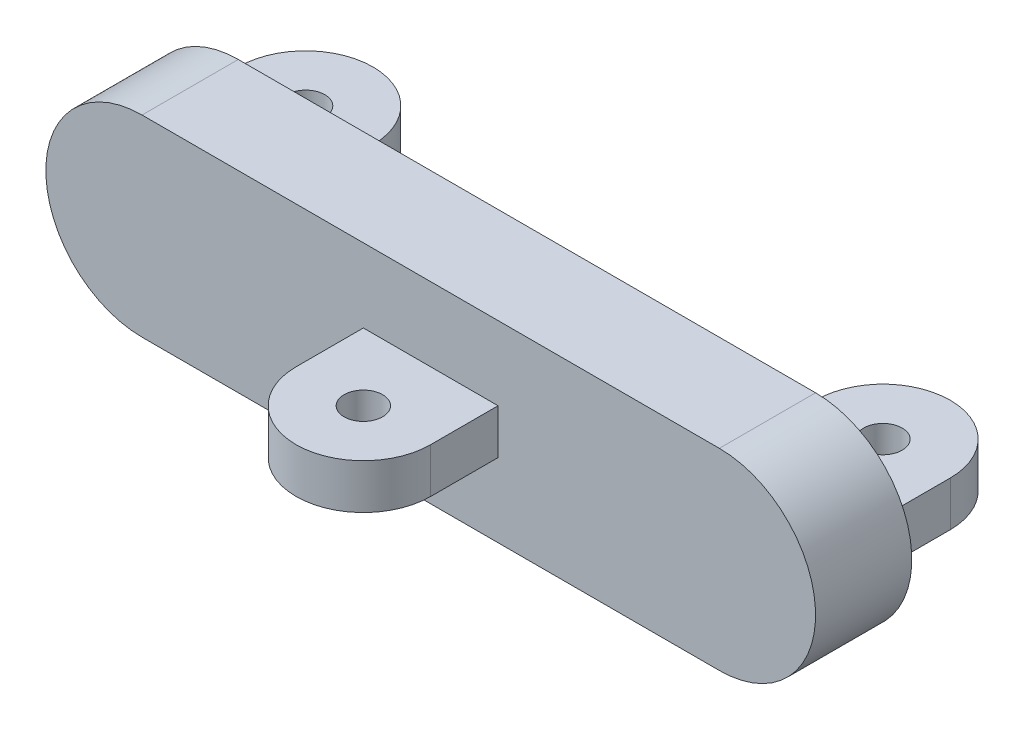
ISO-10303-21;
HEADER;
FILE_DESCRIPTION(('STEP AP214'),'2;1');
FILE_NAME('part.step','',(''),(''),'','','');
FILE_SCHEMA(('AUTOMOTIVE_DESIGN { 1 0 10303 214 1 1 1 1 }'));
ENDSEC;
DATA;
#1=APPLICATION_CONTEXT('core data for automotive mechanical design processes');
#2=APPLICATION_PROTOCOL_DEFINITION('international standard','automotive_design',2000,#1);
#3=PRODUCT_CONTEXT('',#1,'mechanical');
#4=PRODUCT('Part','Part','',(#3));
#5=PRODUCT_RELATED_PRODUCT_CATEGORY('part','',(#4));
#6=PRODUCT_DEFINITION_FORMATION('','',#4);
#7=PRODUCT_DEFINITION_CONTEXT('part definition',#1,'design');
#8=PRODUCT_DEFINITION('design','',#6,#7);
#9=PRODUCT_DEFINITION_SHAPE('','',#8);
#10=(LENGTH_UNIT() NAMED_UNIT(*) SI_UNIT(.MILLI.,.METRE.));
#11=(NAMED_UNIT(*) PLANE_ANGLE_UNIT() SI_UNIT($,.RADIAN.));
#12=(NAMED_UNIT(*) SI_UNIT($,.STERADIAN.) SOLID_ANGLE_UNIT());
#13=UNCERTAINTY_MEASURE_WITH_UNIT(LENGTH_MEASURE(1.E-05),#10,'distance_accuracy_value','');
#14=(GEOMETRIC_REPRESENTATION_CONTEXT(3) GLOBAL_UNCERTAINTY_ASSIGNED_CONTEXT((#13)) GLOBAL_UNIT_ASSIGNED_CONTEXT((#10,
#11,#12)) REPRESENTATION_CONTEXT('',''));
#15=CARTESIAN_POINT('',(0.,0.,0.));
#16=DIRECTION('',(0.,0.,1.));
#17=DIRECTION('',(1.,0.,0.));
#18=AXIS2_PLACEMENT_3D('',#15,#16,#17);
#19=CARTESIAN_POINT('',(15.,0.,-5.));
#20=DIRECTION('',(0.,0.,1.));
#21=DIRECTION('',(1.,0.,0.));
#22=AXIS2_PLACEMENT_3D('',#19,#20,#21);
#23=PLANE('',#22);
#24=DIRECTION('',(0.,1.,0.));
#25=VECTOR('',#24,1.);
#26=CARTESIAN_POINT('',(11.5,-1.165,-5.));
#27=LINE('',#26,#25);
#28=CARTESIAN_POINT('',(11.5,-1.165,-5.));
#29=VERTEX_POINT('',#28);
#30=CARTESIAN_POINT('',(11.5,1.165,-5.));
#31=VERTEX_POINT('',#30);
#32=EDGE_CURVE('E223',#29,#31,#27,.T.);
#33=ORIENTED_EDGE('',*,*,#32,.F.);
#34=DIRECTION('',(-1.,0.,0.));
#35=VECTOR('',#34,1.);
#36=CARTESIAN_POINT('',(18.5,-1.165,-5.));
#37=LINE('',#36,#35);
#38=CARTESIAN_POINT('',(18.5,-1.165,-5.));
#39=VERTEX_POINT('',#38);
#40=EDGE_CURVE('E231',#39,#29,#37,.T.);
#41=ORIENTED_EDGE('',*,*,#40,.F.);
#42=DIRECTION('',(0.,-1.,0.));
#43=VECTOR('',#42,1.);
#44=CARTESIAN_POINT('',(18.5,-1.165,-5.));
#45=LINE('',#44,#43);
#46=CARTESIAN_POINT('',(18.5,1.165,-5.));
#47=VERTEX_POINT('',#46);
#48=EDGE_CURVE('E243',#47,#39,#45,.T.);
#49=ORIENTED_EDGE('',*,*,#48,.F.);
#50=DIRECTION('',(1.,0.,0.));
#51=VECTOR('',#50,1.);
#52=CARTESIAN_POINT('',(18.5,1.165,-5.));
#53=LINE('',#52,#51);
#54=EDGE_CURVE('E239',#31,#47,#53,.T.);
#55=ORIENTED_EDGE('',*,*,#54,.F.);
#56=EDGE_LOOP('',(#33,#41,#49,#55));
#57=FACE_BOUND('',#56,.T.);
#58=CARTESIAN_POINT('',(15.,0.,-5.));
#59=DIRECTION('',(0.,0.,1.));
#60=DIRECTION('',(1.,0.,0.));
#61=AXIS2_PLACEMENT_3D('',#58,#59,#60);
#62=CIRCLE('',#61,5.);
#63=CARTESIAN_POINT('',(15.,-5.,-5.));
#64=VERTEX_POINT('',#63);
#65=CARTESIAN_POINT('',(15.,5.,-5.));
#66=VERTEX_POINT('',#65);
#67=EDGE_CURVE('E318',#64,#66,#62,.T.);
#68=ORIENTED_EDGE('',*,*,#67,.F.);
#69=DIRECTION('',(1.,0.,0.));
#70=VECTOR('',#69,1.);
#71=CARTESIAN_POINT('',(-15.,-5.,-5.));
#72=LINE('',#71,#70);
#73=CARTESIAN_POINT('',(-15.,-5.,-5.));
#74=VERTEX_POINT('',#73);
#75=EDGE_CURVE('E331',#74,#64,#72,.T.);
#76=ORIENTED_EDGE('',*,*,#75,.F.);
#77=CARTESIAN_POINT('',(-15.,0.,-5.));
#78=DIRECTION('',(0.,0.,1.));
#79=DIRECTION('',(-1.,0.,0.));
#80=AXIS2_PLACEMENT_3D('',#77,#78,#79);
#81=CIRCLE('',#80,5.);
#82=CARTESIAN_POINT('',(-15.,5.,-5.));
#83=VERTEX_POINT('',#82);
#84=EDGE_CURVE('E327',#83,#74,#81,.T.);
#85=ORIENTED_EDGE('',*,*,#84,.F.);
#86=DIRECTION('',(-1.,0.,0.));
#87=VECTOR('',#86,1.);
#88=CARTESIAN_POINT('',(-15.,5.,-5.));
#89=LINE('',#88,#87);
#90=EDGE_CURVE('E322',#66,#83,#89,.T.);
#91=ORIENTED_EDGE('',*,*,#90,.F.);
#92=EDGE_LOOP('',(#68,#76,#85,#91));
#93=FACE_BOUND('',#92,.T.);
#94=DIRECTION('',(0.,1.,0.));
#95=VECTOR('',#94,1.);
#96=CARTESIAN_POINT('',(-18.5,-1.165,-5.));
#97=LINE('',#96,#95);
#98=CARTESIAN_POINT('',(-18.5,-1.165,-5.));
#99=VERTEX_POINT('',#98);
#100=CARTESIAN_POINT('',(-18.5,1.165,-5.));
#101=VERTEX_POINT('',#100);
#102=EDGE_CURVE('E220',#99,#101,#97,.T.);
#103=ORIENTED_EDGE('',*,*,#102,.F.);
#104=DIRECTION('',(-1.,0.,0.));
#105=VECTOR('',#104,1.);
#106=CARTESIAN_POINT('',(-18.5,-1.165,-5.));
#107=LINE('',#106,#105);
#108=CARTESIAN_POINT('',(-11.5,-1.165,-5.));
#109=VERTEX_POINT('',#108);
#110=EDGE_CURVE('E169',#109,#99,#107,.T.);
#111=ORIENTED_EDGE('',*,*,#110,.F.);
#112=DIRECTION('',(0.,-1.,0.));
#113=VECTOR('',#112,1.);
#114=CARTESIAN_POINT('',(-11.5,-1.165,-5.));
#115=LINE('',#114,#113);
#116=CARTESIAN_POINT('',(-11.5,1.165,-5.));
#117=VERTEX_POINT('',#116);
#118=EDGE_CURVE('E68',#117,#109,#115,.T.);
#119=ORIENTED_EDGE('',*,*,#118,.F.);
#120=DIRECTION('',(1.,0.,0.));
#121=VECTOR('',#120,1.);
#122=CARTESIAN_POINT('',(-18.5,1.165,-5.));
#123=LINE('',#122,#121);
#124=EDGE_CURVE('E63',#101,#117,#123,.T.);
#125=ORIENTED_EDGE('',*,*,#124,.F.);
#126=EDGE_LOOP('',(#103,#111,#119,#125));
#127=FACE_BOUND('',#126,.T.);
#128=ADVANCED_FACE('F45',(#57,#93,#127),#23,.F.);
#129=CARTESIAN_POINT('',(15.,0.,0.));
#130=DIRECTION('',(0.,0.,1.));
#131=DIRECTION('',(1.,0.,0.));
#132=AXIS2_PLACEMENT_3D('',#129,#130,#131);
#133=PLANE('',#132);
#134=CARTESIAN_POINT('',(15.,0.,0.));
#135=DIRECTION('',(0.,0.,1.));
#136=DIRECTION('',(1.,0.,0.));
#137=AXIS2_PLACEMENT_3D('',#134,#135,#136);
#138=CIRCLE('',#137,5.);
#139=CARTESIAN_POINT('',(15.,-5.,0.));
#140=VERTEX_POINT('',#139);
#141=CARTESIAN_POINT('',(15.,5.,0.));
#142=VERTEX_POINT('',#141);
#143=EDGE_CURVE('E317',#140,#142,#138,.T.);
#144=ORIENTED_EDGE('',*,*,#143,.T.);
#145=DIRECTION('',(-1.,0.,0.));
#146=VECTOR('',#145,1.);
#147=CARTESIAN_POINT('',(-15.,5.,0.));
#148=LINE('',#147,#146);
#149=CARTESIAN_POINT('',(-15.,5.,0.));
#150=VERTEX_POINT('',#149);
#151=EDGE_CURVE('E338',#142,#150,#148,.T.);
#152=ORIENTED_EDGE('',*,*,#151,.T.);
#153=CARTESIAN_POINT('',(-15.,0.,0.));
#154=DIRECTION('',(0.,0.,1.));
#155=DIRECTION('',(-1.,0.,0.));
#156=AXIS2_PLACEMENT_3D('',#153,#154,#155);
#157=CIRCLE('',#156,5.);
#158=CARTESIAN_POINT('',(-15.,-5.,0.));
#159=VERTEX_POINT('',#158);
#160=EDGE_CURVE('E342',#150,#159,#157,.T.);
#161=ORIENTED_EDGE('',*,*,#160,.T.);
#162=DIRECTION('',(1.,0.,0.));
#163=VECTOR('',#162,1.);
#164=CARTESIAN_POINT('',(-15.,-5.,0.));
#165=LINE('',#164,#163);
#166=EDGE_CURVE('E323',#159,#140,#165,.T.);
#167=ORIENTED_EDGE('',*,*,#166,.T.);
#168=EDGE_LOOP('',(#144,#152,#161,#167));
#169=FACE_BOUND('',#168,.T.);
#170=DIRECTION('',(-1.,0.,0.));
#171=VECTOR('',#170,1.);
#172=CARTESIAN_POINT('',(-3.5,1.16666666666667,0.));
#173=LINE('',#172,#171);
#174=CARTESIAN_POINT('',(3.5,1.16666666666667,0.));
#175=VERTEX_POINT('',#174);
#176=CARTESIAN_POINT('',(-3.5,1.16666666666667,0.));
#177=VERTEX_POINT('',#176);
#178=EDGE_CURVE('E295',#175,#177,#173,.T.);
#179=ORIENTED_EDGE('',*,*,#178,.F.);
#180=DIRECTION('',(0.,1.,0.));
#181=VECTOR('',#180,1.);
#182=CARTESIAN_POINT('',(3.5,-1.16666666666667,0.));
#183=LINE('',#182,#181);
#184=CARTESIAN_POINT('',(3.5,-1.16666666666667,0.));
#185=VERTEX_POINT('',#184);
#186=EDGE_CURVE('E281',#185,#175,#183,.T.);
#187=ORIENTED_EDGE('',*,*,#186,.F.);
#188=DIRECTION('',(1.,0.,0.));
#189=VECTOR('',#188,1.);
#190=CARTESIAN_POINT('',(-3.5,-1.16666666666667,0.));
#191=LINE('',#190,#189);
#192=CARTESIAN_POINT('',(-3.5,-1.16666666666667,0.));
#193=VERTEX_POINT('',#192);
#194=EDGE_CURVE('E287',#193,#185,#191,.T.);
#195=ORIENTED_EDGE('',*,*,#194,.F.);
#196=DIRECTION('',(0.,-1.,0.));
#197=VECTOR('',#196,1.);
#198=CARTESIAN_POINT('',(-3.5,-1.16666666666667,0.));
#199=LINE('',#198,#197);
#200=EDGE_CURVE('E298',#177,#193,#199,.T.);
#201=ORIENTED_EDGE('',*,*,#200,.F.);
#202=EDGE_LOOP('',(#179,#187,#195,#201));
#203=FACE_BOUND('',#202,.T.);
#204=ADVANCED_FACE('F362',(#169,#203),#133,.T.);
#205=CARTESIAN_POINT('',(15.,0.,-5.));
#206=DIRECTION('',(0.,0.,1.));
#207=DIRECTION('',(1.,0.,0.));
#208=AXIS2_PLACEMENT_3D('',#205,#206,#207);
#209=CYLINDRICAL_SURFACE('',#208,5.);
#210=ORIENTED_EDGE('',*,*,#143,.F.);
#211=DIRECTION('',(0.,0.,1.));
#212=VECTOR('',#211,1.);
#213=CARTESIAN_POINT('',(15.,-5.,-5.));
#214=LINE('',#213,#212);
#215=EDGE_CURVE('E11',#64,#140,#214,.T.);
#216=ORIENTED_EDGE('',*,*,#215,.F.);
#217=ORIENTED_EDGE('',*,*,#67,.T.);
#218=DIRECTION('',(0.,0.,1.));
#219=VECTOR('',#218,1.);
#220=CARTESIAN_POINT('',(15.,5.,-5.));
#221=LINE('',#220,#219);
#222=EDGE_CURVE('E49',#66,#142,#221,.T.);
#223=ORIENTED_EDGE('',*,*,#222,.T.);
#224=EDGE_LOOP('',(#210,#216,#217,#223));
#225=FACE_BOUND('',#224,.T.);
#226=ADVANCED_FACE('F47',(#225),#209,.T.);
#227=CARTESIAN_POINT('',(-15.,-5.,-5.));
#228=DIRECTION('',(0.,-1.,0.));
#229=DIRECTION('',(0.,0.,-1.));
#230=AXIS2_PLACEMENT_3D('',#227,#228,#229);
#231=PLANE('',#230);
#232=ORIENTED_EDGE('',*,*,#166,.F.);
#233=DIRECTION('',(0.,0.,1.));
#234=VECTOR('',#233,1.);
#235=CARTESIAN_POINT('',(-15.,-5.,-5.));
#236=LINE('',#235,#234);
#237=EDGE_CURVE('E55',#74,#159,#236,.T.);
#238=ORIENTED_EDGE('',*,*,#237,.F.);
#239=ORIENTED_EDGE('',*,*,#75,.T.);
#240=ORIENTED_EDGE('',*,*,#215,.T.);
#241=EDGE_LOOP('',(#232,#238,#239,#240));
#242=FACE_BOUND('',#241,.T.);
#243=ADVANCED_FACE('F366',(#242),#231,.T.);
#244=CARTESIAN_POINT('',(-15.,0.,-5.));
#245=DIRECTION('',(0.,0.,1.));
#246=DIRECTION('',(1.,0.,0.));
#247=AXIS2_PLACEMENT_3D('',#244,#245,#246);
#248=CYLINDRICAL_SURFACE('',#247,5.);
#249=ORIENTED_EDGE('',*,*,#160,.F.);
#250=DIRECTION('',(0.,0.,1.));
#251=VECTOR('',#250,1.);
#252=CARTESIAN_POINT('',(-15.,5.,-5.));
#253=LINE('',#252,#251);
#254=EDGE_CURVE('E350',#83,#150,#253,.T.);
#255=ORIENTED_EDGE('',*,*,#254,.F.);
#256=ORIENTED_EDGE('',*,*,#84,.T.);
#257=ORIENTED_EDGE('',*,*,#237,.T.);
#258=EDGE_LOOP('',(#249,#255,#256,#257));
#259=FACE_BOUND('',#258,.T.);
#260=ADVANCED_FACE('F371',(#259),#248,.T.);
#261=CARTESIAN_POINT('',(-15.,5.,-5.));
#262=DIRECTION('',(0.,1.,0.));
#263=DIRECTION('',(0.,0.,1.));
#264=AXIS2_PLACEMENT_3D('',#261,#262,#263);
#265=PLANE('',#264);
#266=ORIENTED_EDGE('',*,*,#151,.F.);
#267=ORIENTED_EDGE('',*,*,#222,.F.);
#268=ORIENTED_EDGE('',*,*,#90,.T.);
#269=ORIENTED_EDGE('',*,*,#254,.T.);
#270=EDGE_LOOP('',(#266,#267,#268,#269));
#271=FACE_BOUND('',#270,.T.);
#272=ADVANCED_FACE('F360',(#271),#265,.T.);
#273=CARTESIAN_POINT('',(3.5,-1.16666666666667,3.5));
#274=DIRECTION('',(-1.,0.,0.));
#275=DIRECTION('',(0.,0.,1.));
#276=AXIS2_PLACEMENT_3D('',#273,#274,#275);
#277=PLANE('',#276);
#278=ORIENTED_EDGE('',*,*,#186,.T.);
#279=DIRECTION('',(0.,0.,-1.));
#280=VECTOR('',#279,1.);
#281=CARTESIAN_POINT('',(3.5,1.16666666666667,3.5));
#282=LINE('',#281,#280);
#283=CARTESIAN_POINT('',(3.5,1.16666666666667,3.5));
#284=VERTEX_POINT('',#283);
#285=EDGE_CURVE('E314',#284,#175,#282,.T.);
#286=ORIENTED_EDGE('',*,*,#285,.F.);
#287=DIRECTION('',(0.,1.,0.));
#288=VECTOR('',#287,1.);
#289=CARTESIAN_POINT('',(3.5,-1.16666666666667,3.5));
#290=LINE('',#289,#288);
#291=CARTESIAN_POINT('',(3.5,-1.16666666666667,3.5));
#292=VERTEX_POINT('',#291);
#293=EDGE_CURVE('E282',#292,#284,#290,.T.);
#294=ORIENTED_EDGE('',*,*,#293,.F.);
#295=DIRECTION('',(0.,0.,-1.));
#296=VECTOR('',#295,1.);
#297=CARTESIAN_POINT('',(3.5,-1.16666666666667,3.5));
#298=LINE('',#297,#296);
#299=EDGE_CURVE('E291',#292,#185,#298,.T.);
#300=ORIENTED_EDGE('',*,*,#299,.T.);
#301=EDGE_LOOP('',(#278,#286,#294,#300));
#302=FACE_BOUND('',#301,.T.);
#303=ADVANCED_FACE('F378',(#302),#277,.F.);
#304=CARTESIAN_POINT('',(-3.5,1.16666666666667,3.5));
#305=DIRECTION('',(0.,-1.,0.));
#306=DIRECTION('',(0.,0.,-1.));
#307=AXIS2_PLACEMENT_3D('',#304,#305,#306);
#308=PLANE('',#307);
#309=CARTESIAN_POINT('',(0.,1.16666666666667,3.5));
#310=DIRECTION('',(0.,1.,0.));
#311=DIRECTION('',(0.,0.,1.));
#312=AXIS2_PLACEMENT_3D('',#309,#310,#311);
#313=CIRCLE('',#312,1.);
#314=CARTESIAN_POINT('',(0.,1.16666666666667,4.5));
#315=VERTEX_POINT('',#314);
#316=EDGE_CURVE('E265',#315,#315,#313,.T.);
#317=ORIENTED_EDGE('',*,*,#316,.F.);
#318=EDGE_LOOP('',(#317));
#319=FACE_BOUND('',#318,.T.);
#320=ORIENTED_EDGE('',*,*,#178,.T.);
#321=DIRECTION('',(0.,0.,-1.));
#322=VECTOR('',#321,1.);
#323=CARTESIAN_POINT('',(-3.5,1.16666666666667,3.5));
#324=LINE('',#323,#322);
#325=CARTESIAN_POINT('',(-3.5,1.16666666666667,3.5));
#326=VERTEX_POINT('',#325);
#327=EDGE_CURVE('E310',#326,#177,#324,.T.);
#328=ORIENTED_EDGE('',*,*,#327,.F.);
#329=CARTESIAN_POINT('',(0.,1.16666666666667,3.5));
#330=DIRECTION('',(0.,-1.,0.));
#331=DIRECTION('',(1.,0.,0.));
#332=AXIS2_PLACEMENT_3D('',#329,#330,#331);
#333=CIRCLE('',#332,3.5);
#334=EDGE_CURVE('E273',#284,#326,#333,.T.);
#335=ORIENTED_EDGE('',*,*,#334,.F.);
#336=ORIENTED_EDGE('',*,*,#285,.T.);
#337=EDGE_LOOP('',(#320,#328,#335,#336));
#338=FACE_BOUND('',#337,.T.);
#339=ADVANCED_FACE('F392',(#319,#338),#308,.F.);
#340=CARTESIAN_POINT('',(-3.5,-1.16666666666667,3.5));
#341=DIRECTION('',(1.,0.,0.));
#342=DIRECTION('',(0.,0.,-1.));
#343=AXIS2_PLACEMENT_3D('',#340,#341,#342);
#344=PLANE('',#343);
#345=ORIENTED_EDGE('',*,*,#200,.T.);
#346=DIRECTION('',(0.,0.,-1.));
#347=VECTOR('',#346,1.);
#348=CARTESIAN_POINT('',(-3.5,-1.16666666666667,3.5));
#349=LINE('',#348,#347);
#350=CARTESIAN_POINT('',(-3.5,-1.16666666666667,3.5));
#351=VERTEX_POINT('',#350);
#352=EDGE_CURVE('E307',#351,#193,#349,.T.);
#353=ORIENTED_EDGE('',*,*,#352,.F.);
#354=DIRECTION('',(0.,-1.,0.));
#355=VECTOR('',#354,1.);
#356=CARTESIAN_POINT('',(-3.5,-1.16666666666667,3.5));
#357=LINE('',#356,#355);
#358=EDGE_CURVE('E286',#326,#351,#357,.T.);
#359=ORIENTED_EDGE('',*,*,#358,.F.);
#360=ORIENTED_EDGE('',*,*,#327,.T.);
#361=EDGE_LOOP('',(#345,#353,#359,#360));
#362=FACE_BOUND('',#361,.T.);
#363=ADVANCED_FACE('F396',(#362),#344,.F.);
#364=CARTESIAN_POINT('',(-3.5,-1.16666666666667,3.5));
#365=DIRECTION('',(0.,1.,0.));
#366=DIRECTION('',(0.,0.,1.));
#367=AXIS2_PLACEMENT_3D('',#364,#365,#366);
#368=PLANE('',#367);
#369=CARTESIAN_POINT('',(0.,-1.16666666666667,3.5));
#370=DIRECTION('',(0.,1.,0.));
#371=DIRECTION('',(0.,0.,1.));
#372=AXIS2_PLACEMENT_3D('',#369,#370,#371);
#373=CIRCLE('',#372,1.);
#374=CARTESIAN_POINT('',(0.,-1.16666666666667,4.5));
#375=VERTEX_POINT('',#374);
#376=EDGE_CURVE('E269',#375,#375,#373,.F.);
#377=ORIENTED_EDGE('',*,*,#376,.F.);
#378=EDGE_LOOP('',(#377));
#379=FACE_BOUND('',#378,.T.);
#380=ORIENTED_EDGE('',*,*,#194,.T.);
#381=ORIENTED_EDGE('',*,*,#299,.F.);
#382=CARTESIAN_POINT('',(0.,-1.16666666666667,3.5));
#383=DIRECTION('',(0.,-1.,0.));
#384=DIRECTION('',(1.,0.,0.));
#385=AXIS2_PLACEMENT_3D('',#382,#383,#384);
#386=CIRCLE('',#385,3.5);
#387=EDGE_CURVE('E277',#292,#351,#386,.T.);
#388=ORIENTED_EDGE('',*,*,#387,.T.);
#389=ORIENTED_EDGE('',*,*,#352,.T.);
#390=EDGE_LOOP('',(#380,#381,#388,#389));
#391=FACE_BOUND('',#390,.T.);
#392=ADVANCED_FACE('F400',(#379,#391),#368,.F.);
#393=CARTESIAN_POINT('',(0.,1.16666666666667,3.5));
#394=DIRECTION('',(0.,-1.,0.));
#395=DIRECTION('',(1.,0.,0.));
#396=AXIS2_PLACEMENT_3D('',#393,#394,#395);
#397=CYLINDRICAL_SURFACE('',#396,3.5);
#398=ORIENTED_EDGE('',*,*,#293,.T.);
#399=ORIENTED_EDGE('',*,*,#334,.T.);
#400=ORIENTED_EDGE('',*,*,#358,.T.);
#401=ORIENTED_EDGE('',*,*,#387,.F.);
#402=EDGE_LOOP('',(#398,#399,#400,#401));
#403=FACE_BOUND('',#402,.T.);
#404=ADVANCED_FACE('F404',(#403),#397,.T.);
#405=CARTESIAN_POINT('',(0.,-5.001,3.5));
#406=DIRECTION('',(0.,1.,0.));
#407=DIRECTION('',(0.,0.,1.));
#408=AXIS2_PLACEMENT_3D('',#405,#406,#407);
#409=CYLINDRICAL_SURFACE('',#408,1.);
#410=ORIENTED_EDGE('',*,*,#316,.T.);
#411=EDGE_LOOP('',(#410));
#412=FACE_BOUND('',#411,.T.);
#413=ORIENTED_EDGE('',*,*,#376,.T.);
#414=EDGE_LOOP('',(#413));
#415=FACE_BOUND('',#414,.T.);
#416=ADVANCED_FACE('F408',(#412,#415),#409,.F.);
#417=CARTESIAN_POINT('',(11.5,-1.165,-8.5));
#418=DIRECTION('',(1.,0.,0.));
#419=DIRECTION('',(0.,0.,-1.));
#420=AXIS2_PLACEMENT_3D('',#417,#418,#419);
#421=PLANE('',#420);
#422=ORIENTED_EDGE('',*,*,#32,.T.);
#423=DIRECTION('',(0.,0.,1.));
#424=VECTOR('',#423,1.);
#425=CARTESIAN_POINT('',(11.5,1.165,-8.5));
#426=LINE('',#425,#424);
#427=CARTESIAN_POINT('',(11.5,1.165,-8.5));
#428=VERTEX_POINT('',#427);
#429=EDGE_CURVE('E261',#428,#31,#426,.T.);
#430=ORIENTED_EDGE('',*,*,#429,.F.);
#431=DIRECTION('',(0.,1.,0.));
#432=VECTOR('',#431,1.);
#433=CARTESIAN_POINT('',(11.5,-1.165,-8.5));
#434=LINE('',#433,#432);
#435=CARTESIAN_POINT('',(11.5,-1.165,-8.49999999999998));
#436=VERTEX_POINT('',#435);
#437=EDGE_CURVE('E226',#436,#428,#434,.T.);
#438=ORIENTED_EDGE('',*,*,#437,.F.);
#439=DIRECTION('',(0.,0.,1.));
#440=VECTOR('',#439,1.);
#441=CARTESIAN_POINT('',(11.5,-1.165,-8.5));
#442=LINE('',#441,#440);
#443=EDGE_CURVE('E235',#436,#29,#442,.T.);
#444=ORIENTED_EDGE('',*,*,#443,.T.);
#445=EDGE_LOOP('',(#422,#430,#438,#444));
#446=FACE_BOUND('',#445,.T.);
#447=ADVANCED_FACE('F411',(#446),#421,.F.);
#448=CARTESIAN_POINT('',(18.5,1.165,-8.5));
#449=DIRECTION('',(0.,-1.,0.));
#450=DIRECTION('',(0.,0.,-1.));
#451=AXIS2_PLACEMENT_3D('',#448,#449,#450);
#452=PLANE('',#451);
#453=CARTESIAN_POINT('',(15.,1.165,-8.5));
#454=DIRECTION('',(0.,1.,0.));
#455=DIRECTION('',(0.,0.,-1.));
#456=AXIS2_PLACEMENT_3D('',#453,#454,#455);
#457=CIRCLE('',#456,1.);
#458=CARTESIAN_POINT('',(15.,1.165,-9.5));
#459=VERTEX_POINT('',#458);
#460=EDGE_CURVE('E196',#459,#459,#457,.T.);
#461=ORIENTED_EDGE('',*,*,#460,.F.);
#462=EDGE_LOOP('',(#461));
#463=FACE_BOUND('',#462,.T.);
#464=ORIENTED_EDGE('',*,*,#54,.T.);
#465=DIRECTION('',(0.,0.,1.));
#466=VECTOR('',#465,1.);
#467=CARTESIAN_POINT('',(18.5,1.165,-8.5));
#468=LINE('',#467,#466);
#469=CARTESIAN_POINT('',(18.5,1.165,-8.5));
#470=VERTEX_POINT('',#469);
#471=EDGE_CURVE('E257',#470,#47,#468,.T.);
#472=ORIENTED_EDGE('',*,*,#471,.F.);
#473=CARTESIAN_POINT('',(15.,1.165,-8.5));
#474=DIRECTION('',(0.,-1.,0.));
#475=DIRECTION('',(0.,0.,-1.));
#476=AXIS2_PLACEMENT_3D('',#473,#474,#475);
#477=CIRCLE('',#476,3.5);
#478=EDGE_CURVE('E202',#428,#470,#477,.T.);
#479=ORIENTED_EDGE('',*,*,#478,.F.);
#480=ORIENTED_EDGE('',*,*,#429,.T.);
#481=EDGE_LOOP('',(#464,#472,#479,#480));
#482=FACE_BOUND('',#481,.T.);
#483=ADVANCED_FACE('F414',(#463,#482),#452,.F.);
#484=CARTESIAN_POINT('',(18.5,-1.165,-8.5));
#485=DIRECTION('',(-1.,0.,0.));
#486=DIRECTION('',(0.,0.,1.));
#487=AXIS2_PLACEMENT_3D('',#484,#485,#486);
#488=PLANE('',#487);
#489=ORIENTED_EDGE('',*,*,#48,.T.);
#490=DIRECTION('',(0.,0.,1.));
#491=VECTOR('',#490,1.);
#492=CARTESIAN_POINT('',(18.5,-1.165,-8.5));
#493=LINE('',#492,#491);
#494=CARTESIAN_POINT('',(18.5,-1.165,-8.5));
#495=VERTEX_POINT('',#494);
#496=EDGE_CURVE('E253',#495,#39,#493,.T.);
#497=ORIENTED_EDGE('',*,*,#496,.F.);
#498=DIRECTION('',(0.,-1.,0.));
#499=VECTOR('',#498,1.);
#500=CARTESIAN_POINT('',(18.5,-1.165,-8.5));
#501=LINE('',#500,#499);
#502=EDGE_CURVE('E230',#470,#495,#501,.T.);
#503=ORIENTED_EDGE('',*,*,#502,.F.);
#504=ORIENTED_EDGE('',*,*,#471,.T.);
#505=EDGE_LOOP('',(#489,#497,#503,#504));
#506=FACE_BOUND('',#505,.T.);
#507=ADVANCED_FACE('F418',(#506),#488,.F.);
#508=CARTESIAN_POINT('',(18.5,-1.165,-8.5));
#509=DIRECTION('',(0.,1.,0.));
#510=DIRECTION('',(0.,0.,1.));
#511=AXIS2_PLACEMENT_3D('',#508,#509,#510);
#512=PLANE('',#511);
#513=CARTESIAN_POINT('',(15.,-1.165,-8.5));
#514=DIRECTION('',(0.,1.,0.));
#515=DIRECTION('',(0.,0.,1.));
#516=AXIS2_PLACEMENT_3D('',#513,#514,#515);
#517=CIRCLE('',#516,1.);
#518=CARTESIAN_POINT('',(15.,-1.165,-7.5));
#519=VERTEX_POINT('',#518);
#520=EDGE_CURVE('E463',#519,#519,#517,.F.);
#521=ORIENTED_EDGE('',*,*,#520,.F.);
#522=EDGE_LOOP('',(#521));
#523=FACE_BOUND('',#522,.T.);
#524=ORIENTED_EDGE('',*,*,#40,.T.);
#525=ORIENTED_EDGE('',*,*,#443,.F.);
#526=CARTESIAN_POINT('',(15.,-1.165,-8.5));
#527=DIRECTION('',(0.,-1.,0.));
#528=DIRECTION('',(0.,0.,-1.));
#529=AXIS2_PLACEMENT_3D('',#526,#527,#528);
#530=CIRCLE('',#529,3.5);
#531=EDGE_CURVE('E190',#436,#495,#530,.T.);
#532=ORIENTED_EDGE('',*,*,#531,.T.);
#533=ORIENTED_EDGE('',*,*,#496,.T.);
#534=EDGE_LOOP('',(#524,#525,#532,#533));
#535=FACE_BOUND('',#534,.T.);
#536=ADVANCED_FACE('F422',(#523,#535),#512,.F.);
#537=CARTESIAN_POINT('',(-18.5,-1.165,-8.5));
#538=DIRECTION('',(1.,0.,0.));
#539=DIRECTION('',(0.,0.,-1.));
#540=AXIS2_PLACEMENT_3D('',#537,#538,#539);
#541=PLANE('',#540);
#542=ORIENTED_EDGE('',*,*,#102,.T.);
#543=DIRECTION('',(0.,0.,1.));
#544=VECTOR('',#543,1.);
#545=CARTESIAN_POINT('',(-18.5,1.165,-8.5));
#546=LINE('',#545,#544);
#547=CARTESIAN_POINT('',(-18.5,1.165,-8.5));
#548=VERTEX_POINT('',#547);
#549=EDGE_CURVE('E163',#548,#101,#546,.T.);
#550=ORIENTED_EDGE('',*,*,#549,.F.);
#551=DIRECTION('',(0.,1.,0.));
#552=VECTOR('',#551,1.);
#553=CARTESIAN_POINT('',(-18.5,-1.165,-8.5));
#554=LINE('',#553,#552);
#555=CARTESIAN_POINT('',(-18.5,-1.165,-8.49999999999998));
#556=VERTEX_POINT('',#555);
#557=EDGE_CURVE('E158',#556,#548,#554,.T.);
#558=ORIENTED_EDGE('',*,*,#557,.F.);
#559=DIRECTION('',(0.,0.,1.));
#560=VECTOR('',#559,1.);
#561=CARTESIAN_POINT('',(-18.5,-1.165,-8.5));
#562=LINE('',#561,#560);
#563=EDGE_CURVE('E162',#556,#99,#562,.T.);
#564=ORIENTED_EDGE('',*,*,#563,.T.);
#565=EDGE_LOOP('',(#542,#550,#558,#564));
#566=FACE_BOUND('',#565,.T.);
#567=ADVANCED_FACE('F161',(#566),#541,.F.);
#568=CARTESIAN_POINT('',(-18.5,1.165,-8.5));
#569=DIRECTION('',(0.,-1.,0.));
#570=DIRECTION('',(0.,0.,-1.));
#571=AXIS2_PLACEMENT_3D('',#568,#569,#570);
#572=PLANE('',#571);
#573=CARTESIAN_POINT('',(-15.,1.165,-8.5));
#574=DIRECTION('',(0.,1.,0.));
#575=DIRECTION('',(0.,0.,1.));
#576=AXIS2_PLACEMENT_3D('',#573,#574,#575);
#577=CIRCLE('',#576,1.);
#578=CARTESIAN_POINT('',(-15.,1.165,-7.5));
#579=VERTEX_POINT('',#578);
#580=EDGE_CURVE('E193',#579,#579,#577,.T.);
#581=ORIENTED_EDGE('',*,*,#580,.F.);
#582=EDGE_LOOP('',(#581));
#583=FACE_BOUND('',#582,.T.);
#584=ORIENTED_EDGE('',*,*,#124,.T.);
#585=DIRECTION('',(0.,0.,1.));
#586=VECTOR('',#585,1.);
#587=CARTESIAN_POINT('',(-11.5,1.165,-8.5));
#588=LINE('',#587,#586);
#589=CARTESIAN_POINT('',(-11.5,1.165,-8.5));
#590=VERTEX_POINT('',#589);
#591=EDGE_CURVE('E208',#590,#117,#588,.T.);
#592=ORIENTED_EDGE('',*,*,#591,.F.);
#593=CARTESIAN_POINT('',(-15.,1.165,-8.5));
#594=DIRECTION('',(0.,-1.,0.));
#595=DIRECTION('',(0.,0.,-1.));
#596=AXIS2_PLACEMENT_3D('',#593,#594,#595);
#597=CIRCLE('',#596,3.5);
#598=EDGE_CURVE('E185',#548,#590,#597,.T.);
#599=ORIENTED_EDGE('',*,*,#598,.F.);
#600=ORIENTED_EDGE('',*,*,#549,.T.);
#601=EDGE_LOOP('',(#584,#592,#599,#600));
#602=FACE_BOUND('',#601,.T.);
#603=ADVANCED_FACE('F434',(#583,#602),#572,.F.);
#604=CARTESIAN_POINT('',(-11.5,-1.165,-8.5));
#605=DIRECTION('',(-1.,0.,0.));
#606=DIRECTION('',(0.,0.,1.));
#607=AXIS2_PLACEMENT_3D('',#604,#605,#606);
#608=PLANE('',#607);
#609=ORIENTED_EDGE('',*,*,#118,.T.);
#610=DIRECTION('',(0.,0.,1.));
#611=VECTOR('',#610,1.);
#612=CARTESIAN_POINT('',(-11.5,-1.165,-8.5));
#613=LINE('',#612,#611);
#614=CARTESIAN_POINT('',(-11.5,-1.165,-8.5));
#615=VERTEX_POINT('',#614);
#616=EDGE_CURVE('E180',#615,#109,#613,.T.);
#617=ORIENTED_EDGE('',*,*,#616,.F.);
#618=DIRECTION('',(0.,-1.,0.));
#619=VECTOR('',#618,1.);
#620=CARTESIAN_POINT('',(-11.5,-1.165,-8.5));
#621=LINE('',#620,#619);
#622=EDGE_CURVE('E170',#590,#615,#621,.T.);
#623=ORIENTED_EDGE('',*,*,#622,.F.);
#624=ORIENTED_EDGE('',*,*,#591,.T.);
#625=EDGE_LOOP('',(#609,#617,#623,#624));
#626=FACE_BOUND('',#625,.T.);
#627=ADVANCED_FACE('F430',(#626),#608,.F.);
#628=CARTESIAN_POINT('',(-18.5,-1.165,-8.5));
#629=DIRECTION('',(0.,1.,0.));
#630=DIRECTION('',(0.,0.,1.));
#631=AXIS2_PLACEMENT_3D('',#628,#629,#630);
#632=PLANE('',#631);
#633=CARTESIAN_POINT('',(-15.,-1.165,-8.5));
#634=DIRECTION('',(0.,1.,0.));
#635=DIRECTION('',(0.,0.,1.));
#636=AXIS2_PLACEMENT_3D('',#633,#634,#635);
#637=CIRCLE('',#636,1.);
#638=CARTESIAN_POINT('',(-15.,-1.165,-7.5));
#639=VERTEX_POINT('',#638);
#640=EDGE_CURVE('E186',#639,#639,#637,.F.);
#641=ORIENTED_EDGE('',*,*,#640,.F.);
#642=EDGE_LOOP('',(#641));
#643=FACE_BOUND('',#642,.T.);
#644=ORIENTED_EDGE('',*,*,#110,.T.);
#645=ORIENTED_EDGE('',*,*,#563,.F.);
#646=CARTESIAN_POINT('',(-15.,-1.165,-8.5));
#647=DIRECTION('',(0.,-1.,0.));
#648=DIRECTION('',(0.,0.,-1.));
#649=AXIS2_PLACEMENT_3D('',#646,#647,#648);
#650=CIRCLE('',#649,3.5);
#651=EDGE_CURVE('E177',#556,#615,#650,.T.);
#652=ORIENTED_EDGE('',*,*,#651,.T.);
#653=ORIENTED_EDGE('',*,*,#616,.T.);
#654=EDGE_LOOP('',(#644,#645,#652,#653));
#655=FACE_BOUND('',#654,.T.);
#656=ADVANCED_FACE('F175',(#643,#655),#632,.F.);
#657=CARTESIAN_POINT('',(15.,1.165,-8.5));
#658=DIRECTION('',(0.,-1.,0.));
#659=DIRECTION('',(0.,0.,-1.));
#660=AXIS2_PLACEMENT_3D('',#657,#658,#659);
#661=CYLINDRICAL_SURFACE('',#660,3.5);
#662=ORIENTED_EDGE('',*,*,#531,.F.);
#663=ORIENTED_EDGE('',*,*,#437,.T.);
#664=ORIENTED_EDGE('',*,*,#478,.T.);
#665=ORIENTED_EDGE('',*,*,#502,.T.);
#666=EDGE_LOOP('',(#662,#663,#664,#665));
#667=FACE_BOUND('',#666,.T.);
#668=ADVANCED_FACE('F429',(#667),#661,.T.);
#669=CARTESIAN_POINT('',(-15.,1.165,-8.5));
#670=DIRECTION('',(0.,-1.,0.));
#671=DIRECTION('',(0.,0.,-1.));
#672=AXIS2_PLACEMENT_3D('',#669,#670,#671);
#673=CYLINDRICAL_SURFACE('',#672,3.5);
#674=ORIENTED_EDGE('',*,*,#651,.F.);
#675=ORIENTED_EDGE('',*,*,#557,.T.);
#676=ORIENTED_EDGE('',*,*,#598,.T.);
#677=ORIENTED_EDGE('',*,*,#622,.T.);
#678=EDGE_LOOP('',(#674,#675,#676,#677));
#679=FACE_BOUND('',#678,.T.);
#680=ADVANCED_FACE('F182',(#679),#673,.T.);
#681=CARTESIAN_POINT('',(-15.,-5.001,-8.5));
#682=DIRECTION('',(0.,1.,0.));
#683=DIRECTION('',(0.,0.,1.));
#684=AXIS2_PLACEMENT_3D('',#681,#682,#683);
#685=CYLINDRICAL_SURFACE('',#684,1.);
#686=ORIENTED_EDGE('',*,*,#580,.T.);
#687=EDGE_LOOP('',(#686));
#688=FACE_BOUND('',#687,.T.);
#689=ORIENTED_EDGE('',*,*,#640,.T.);
#690=EDGE_LOOP('',(#689));
#691=FACE_BOUND('',#690,.T.);
#692=ADVANCED_FACE('F446',(#688,#691),#685,.F.);
#693=CARTESIAN_POINT('',(15.,-5.001,-8.5));
#694=DIRECTION('',(0.,1.,0.));
#695=DIRECTION('',(0.,0.,1.));
#696=AXIS2_PLACEMENT_3D('',#693,#694,#695);
#697=CYLINDRICAL_SURFACE('',#696,1.);
#698=ORIENTED_EDGE('',*,*,#460,.T.);
#699=EDGE_LOOP('',(#698));
#700=FACE_BOUND('',#699,.T.);
#701=ORIENTED_EDGE('',*,*,#520,.T.);
#702=EDGE_LOOP('',(#701));
#703=FACE_BOUND('',#702,.T.);
#704=ADVANCED_FACE('F447',(#700,#703),#697,.F.);
#705=CLOSED_SHELL('',(#128,#204,#226,#243,#260,#272,#303,#339,#363,#392,#404,#416,#447,#483,
#507,#536,#567,#603,#627,#656,#668,#680,#692,#704));
#706=MANIFOLD_SOLID_BREP('B2',#705);
#707=ADVANCED_BREP_SHAPE_REPRESENTATION('',(#18,#706),#14);
#708=SHAPE_DEFINITION_REPRESENTATION(#9,#707);
ENDSEC;
END-ISO-10303-21;
